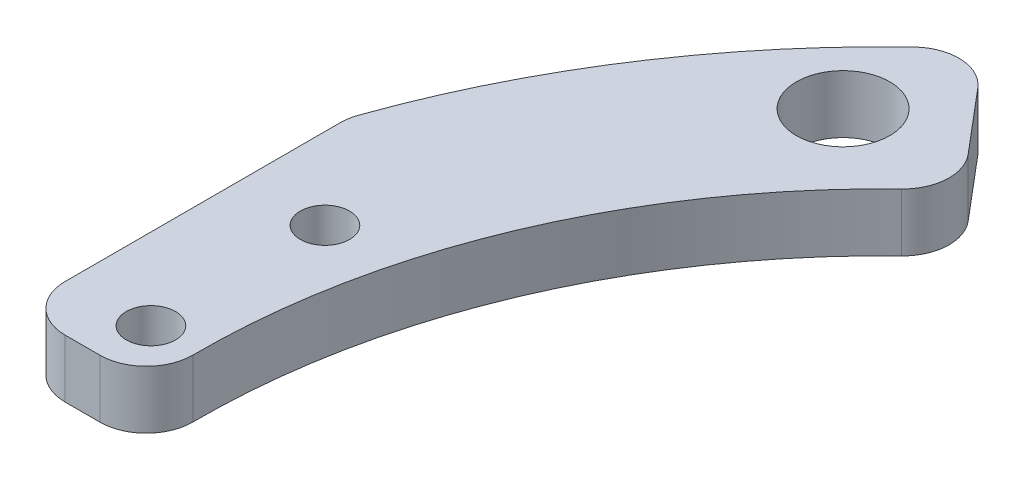
ISO-10303-21;
HEADER;
FILE_DESCRIPTION(('STEP AP214'),'2;1');
FILE_NAME('part.step','',(''),(''),'','','');
FILE_SCHEMA(('AUTOMOTIVE_DESIGN { 1 0 10303 214 1 1 1 1 }'));
ENDSEC;
DATA;
#1=APPLICATION_CONTEXT('core data for automotive mechanical design processes');
#2=APPLICATION_PROTOCOL_DEFINITION('international standard','automotive_design',2000,#1);
#3=PRODUCT_CONTEXT('',#1,'mechanical');
#4=PRODUCT('Part','Part','',(#3));
#5=PRODUCT_RELATED_PRODUCT_CATEGORY('part','',(#4));
#6=PRODUCT_DEFINITION_FORMATION('','',#4);
#7=PRODUCT_DEFINITION_CONTEXT('part definition',#1,'design');
#8=PRODUCT_DEFINITION('design','',#6,#7);
#9=PRODUCT_DEFINITION_SHAPE('','',#8);
#10=(LENGTH_UNIT() NAMED_UNIT(*) SI_UNIT(.MILLI.,.METRE.));
#11=(NAMED_UNIT(*) PLANE_ANGLE_UNIT() SI_UNIT($,.RADIAN.));
#12=(NAMED_UNIT(*) SI_UNIT($,.STERADIAN.) SOLID_ANGLE_UNIT());
#13=UNCERTAINTY_MEASURE_WITH_UNIT(LENGTH_MEASURE(1.E-05),#10,'distance_accuracy_value','');
#14=(GEOMETRIC_REPRESENTATION_CONTEXT(3) GLOBAL_UNCERTAINTY_ASSIGNED_CONTEXT((#13)) GLOBAL_UNIT_ASSIGNED_CONTEXT((#10,
#11,#12)) REPRESENTATION_CONTEXT('',''));
#15=CARTESIAN_POINT('',(0.,0.,0.));
#16=DIRECTION('',(0.,0.,1.));
#17=DIRECTION('',(1.,0.,0.));
#18=AXIS2_PLACEMENT_3D('',#15,#16,#17);
#19=CARTESIAN_POINT('',(0.,5.,0.));
#20=DIRECTION('',(0.,1.,0.));
#21=DIRECTION('',(0.,0.,1.));
#22=AXIS2_PLACEMENT_3D('',#19,#20,#21);
#23=PLANE('',#22);
#24=CARTESIAN_POINT('',(0.,5.,0.));
#25=DIRECTION('',(0.,1.,0.));
#26=DIRECTION('',(0.,0.,1.));
#27=AXIS2_PLACEMENT_3D('',#24,#25,#26);
#28=CIRCLE('',#27,74.);
#29=CARTESIAN_POINT('',(-50.9093941537347,5.,-53.7050610920394));
#30=VERTEX_POINT('',#29);
#31=CARTESIAN_POINT('',(-69.7714285714286,5.,-24.6565965839172));
#32=VERTEX_POINT('',#31);
#33=EDGE_CURVE('E126',#30,#32,#28,.T.);
#34=ORIENTED_EDGE('',*,*,#33,.T.);
#35=CARTESIAN_POINT('',(-66.,5.,-23.3238075793812));
#36=DIRECTION('',(0.,1.,0.));
#37=DIRECTION('',(0.,0.,1.));
#38=AXIS2_PLACEMENT_3D('',#35,#36,#37);
#39=CIRCLE('',#38,4.);
#40=CARTESIAN_POINT('',(-70.,5.,-23.3238075793812));
#41=VERTEX_POINT('',#40);
#42=EDGE_CURVE('E157',#32,#41,#39,.T.);
#43=ORIENTED_EDGE('',*,*,#42,.T.);
#44=DIRECTION('',(0.,0.,-1.));
#45=VECTOR('',#44,1.);
#46=CARTESIAN_POINT('',(-70.,5.,0.));
#47=LINE('',#46,#45);
#48=CARTESIAN_POINT('',(-70.,5.,0.398778143483318));
#49=VERTEX_POINT('',#48);
#50=EDGE_CURVE('E201',#49,#41,#47,.T.);
#51=ORIENTED_EDGE('',*,*,#50,.F.);
#52=CARTESIAN_POINT('',(-66.,5.,0.398778143483318));
#53=DIRECTION('',(0.,1.,0.));
#54=DIRECTION('',(0.,0.,1.));
#55=AXIS2_PLACEMENT_3D('',#52,#53,#54);
#56=CIRCLE('',#55,4.);
#57=CARTESIAN_POINT('',(-66.,5.,4.39877814348332));
#58=VERTEX_POINT('',#57);
#59=EDGE_CURVE('E155',#49,#58,#56,.T.);
#60=ORIENTED_EDGE('',*,*,#59,.T.);
#61=DIRECTION('',(-1.,0.,0.));
#62=VECTOR('',#61,1.);
#63=CARTESIAN_POINT('',(0.,5.,4.39877814348332));
#64=LINE('',#63,#62);
#65=CARTESIAN_POINT('',(-62.9987378920584,5.,4.39877814348332));
#66=VERTEX_POINT('',#65);
#67=EDGE_CURVE('E208',#66,#58,#64,.T.);
#68=ORIENTED_EDGE('',*,*,#67,.F.);
#69=CARTESIAN_POINT('',(-62.9987378920584,5.,0.398778143483318));
#70=DIRECTION('',(0.,1.,0.));
#71=DIRECTION('',(0.,0.,1.));
#72=AXIS2_PLACEMENT_3D('',#69,#70,#71);
#73=CIRCLE('',#72,4.);
#74=CARTESIAN_POINT('',(-58.998818025896,5.,0.373458896278028));
#75=VERTEX_POINT('',#74);
#76=EDGE_CURVE('E153',#66,#75,#73,.T.);
#77=ORIENTED_EDGE('',*,*,#76,.T.);
#78=CARTESIAN_POINT('',(0.,5.,0.));
#79=DIRECTION('',(0.,-1.,0.));
#80=DIRECTION('',(0.,0.,1.));
#81=AXIS2_PLACEMENT_3D('',#78,#79,#80);
#82=CIRCLE('',#81,59.);
#83=CARTESIAN_POINT('',(-40.8614618035536,5.,-42.55985126004));
#84=VERTEX_POINT('',#83);
#85=EDGE_CURVE('E185',#75,#84,#82,.T.);
#86=ORIENTED_EDGE('',*,*,#85,.T.);
#87=CARTESIAN_POINT('',(-43.6317304004047,5.,-45.4452649047885));
#88=DIRECTION('',(0.,1.,0.));
#89=DIRECTION('',(0.,0.,1.));
#90=AXIS2_PLACEMENT_3D('',#87,#88,#89);
#91=CIRCLE('',#90,4.);
#92=CARTESIAN_POINT('',(-40.5762484597032,5.,-48.026743184776));
#93=VERTEX_POINT('',#92);
#94=EDGE_CURVE('E151',#84,#93,#91,.T.);
#95=ORIENTED_EDGE('',*,*,#94,.T.);
#96=DIRECTION('',(-0.64536956999688,0.,-0.763870485175361));
#97=VECTOR('',#96,1.);
#98=CARTESIAN_POINT('',(-47.7573481797691,5.,-56.5264159029767));
#99=LINE('',#98,#97);
#100=CARTESIAN_POINT('',(-45.1020530695882,5.,-53.3835630967815));
#101=VERTEX_POINT('',#100);
#102=EDGE_CURVE('E128',#93,#101,#99,.T.);
#103=ORIENTED_EDGE('',*,*,#102,.T.);
#104=CARTESIAN_POINT('',(-48.1575350102896,5.,-50.802084816794));
#105=DIRECTION('',(0.,1.,0.));
#106=DIRECTION('',(0.,0.,1.));
#107=AXIS2_PLACEMENT_3D('',#104,#105,#106);
#108=CIRCLE('',#107,4.);
#109=EDGE_CURVE('E149',#101,#30,#108,.T.);
#110=ORIENTED_EDGE('',*,*,#109,.T.);
#111=EDGE_LOOP('',(#34,#43,#51,#60,#68,#77,#86,#95,#103,#110));
#112=FACE_BOUND('',#111,.T.);
#113=CARTESIAN_POINT('',(-49.3663748592939,5.,-46.0348893042187));
#114=DIRECTION('',(0.,1.,0.));
#115=DIRECTION('',(0.,0.,1.));
#116=AXIS2_PLACEMENT_3D('',#113,#114,#115);
#117=CIRCLE('',#116,4.025);
#118=CARTESIAN_POINT('',(-49.3663748592939,5.,-42.0098893042187));
#119=VERTEX_POINT('',#118);
#120=EDGE_CURVE('E190',#119,#119,#117,.T.);
#121=ORIENTED_EDGE('',*,*,#120,.F.);
#122=EDGE_LOOP('',(#121));
#123=FACE_BOUND('',#122,.T.);
#124=CARTESIAN_POINT('',(-63.,5.,0.));
#125=DIRECTION('',(0.,1.,0.));
#126=DIRECTION('',(0.,0.,1.));
#127=AXIS2_PLACEMENT_3D('',#124,#125,#126);
#128=CIRCLE('',#127,2.125);
#129=CARTESIAN_POINT('',(-63.,5.,2.12500000000001));
#130=VERTEX_POINT('',#129);
#131=EDGE_CURVE('E136',#130,#130,#128,.T.);
#132=ORIENTED_EDGE('',*,*,#131,.F.);
#133=EDGE_LOOP('',(#132));
#134=FACE_BOUND('',#133,.T.);
#135=CARTESIAN_POINT('',(-63.,5.,-15.));
#136=DIRECTION('',(0.,1.,0.));
#137=DIRECTION('',(0.,0.,1.));
#138=AXIS2_PLACEMENT_3D('',#135,#136,#137);
#139=CIRCLE('',#138,2.125);
#140=CARTESIAN_POINT('',(-63.,5.,-12.875));
#141=VERTEX_POINT('',#140);
#142=EDGE_CURVE('E195',#141,#141,#139,.T.);
#143=ORIENTED_EDGE('',*,*,#142,.F.);
#144=EDGE_LOOP('',(#143));
#145=FACE_BOUND('',#144,.T.);
#146=ADVANCED_FACE('F35',(#112,#123,#134,#145),#23,.T.);
#147=CARTESIAN_POINT('',(0.,0.,0.));
#148=DIRECTION('',(0.,1.,0.));
#149=DIRECTION('',(0.,0.,1.));
#150=AXIS2_PLACEMENT_3D('',#147,#148,#149);
#151=PLANE('',#150);
#152=DIRECTION('',(0.,0.,-1.));
#153=VECTOR('',#152,1.);
#154=CARTESIAN_POINT('',(-70.,0.,-27.6660560000425));
#155=LINE('',#154,#153);
#156=CARTESIAN_POINT('',(-70.,0.,0.398778143483318));
#157=VERTEX_POINT('',#156);
#158=CARTESIAN_POINT('',(-70.,0.,-23.3238075793812));
#159=VERTEX_POINT('',#158);
#160=EDGE_CURVE('E206',#157,#159,#155,.T.);
#161=ORIENTED_EDGE('',*,*,#160,.T.);
#162=CARTESIAN_POINT('',(-66.,0.,-23.3238075793812));
#163=DIRECTION('',(0.,1.,0.));
#164=DIRECTION('',(0.,0.,1.));
#165=AXIS2_PLACEMENT_3D('',#162,#163,#164);
#166=CIRCLE('',#165,4.);
#167=CARTESIAN_POINT('',(-69.7714285714286,0.,-24.6565965839172));
#168=VERTEX_POINT('',#167);
#169=EDGE_CURVE('E134',#159,#168,#166,.F.);
#170=ORIENTED_EDGE('',*,*,#169,.T.);
#171=CARTESIAN_POINT('',(0.,0.,0.));
#172=DIRECTION('',(0.,1.,0.));
#173=DIRECTION('',(0.,0.,1.));
#174=AXIS2_PLACEMENT_3D('',#171,#172,#173);
#175=CIRCLE('',#174,74.);
#176=CARTESIAN_POINT('',(-50.9093941537347,0.,-53.7050610920394));
#177=VERTEX_POINT('',#176);
#178=EDGE_CURVE('E123',#177,#168,#175,.T.);
#179=ORIENTED_EDGE('',*,*,#178,.F.);
#180=CARTESIAN_POINT('',(-48.1575350102896,0.,-50.802084816794));
#181=DIRECTION('',(0.,1.,0.));
#182=DIRECTION('',(0.,0.,1.));
#183=AXIS2_PLACEMENT_3D('',#180,#181,#182);
#184=CIRCLE('',#183,4.);
#185=CARTESIAN_POINT('',(-45.1020530695882,0.,-53.3835630967815));
#186=VERTEX_POINT('',#185);
#187=EDGE_CURVE('E50',#177,#186,#184,.F.);
#188=ORIENTED_EDGE('',*,*,#187,.T.);
#189=DIRECTION('',(-0.64536956999688,0.,-0.763870485175361));
#190=VECTOR('',#189,1.);
#191=CARTESIAN_POINT('',(-47.7573481797691,0.,-56.5264159029767));
#192=LINE('',#191,#190);
#193=CARTESIAN_POINT('',(-40.5762484597032,0.,-48.026743184776));
#194=VERTEX_POINT('',#193);
#195=EDGE_CURVE('E139',#194,#186,#192,.T.);
#196=ORIENTED_EDGE('',*,*,#195,.F.);
#197=CARTESIAN_POINT('',(-43.6317304004047,0.,-45.4452649047885));
#198=DIRECTION('',(0.,1.,0.));
#199=DIRECTION('',(0.,0.,1.));
#200=AXIS2_PLACEMENT_3D('',#197,#198,#199);
#201=CIRCLE('',#200,4.);
#202=CARTESIAN_POINT('',(-40.8614618035536,0.,-42.55985126004));
#203=VERTEX_POINT('',#202);
#204=EDGE_CURVE('E58',#194,#203,#201,.F.);
#205=ORIENTED_EDGE('',*,*,#204,.T.);
#206=CARTESIAN_POINT('',(0.,0.,0.));
#207=DIRECTION('',(0.,-1.,0.));
#208=DIRECTION('',(0.,0.,1.));
#209=AXIS2_PLACEMENT_3D('',#206,#207,#208);
#210=CIRCLE('',#209,59.);
#211=CARTESIAN_POINT('',(-58.998818025896,0.,0.373458896278028));
#212=VERTEX_POINT('',#211);
#213=EDGE_CURVE('E135',#212,#203,#210,.T.);
#214=ORIENTED_EDGE('',*,*,#213,.F.);
#215=CARTESIAN_POINT('',(-62.9987378920584,0.,0.398778143483318));
#216=DIRECTION('',(0.,1.,0.));
#217=DIRECTION('',(0.,0.,1.));
#218=AXIS2_PLACEMENT_3D('',#215,#216,#217);
#219=CIRCLE('',#218,4.);
#220=CARTESIAN_POINT('',(-62.9987378920584,0.,4.39877814348332));
#221=VERTEX_POINT('',#220);
#222=EDGE_CURVE('E164',#212,#221,#219,.F.);
#223=ORIENTED_EDGE('',*,*,#222,.T.);
#224=DIRECTION('',(-1.,0.,0.));
#225=VECTOR('',#224,1.);
#226=CARTESIAN_POINT('',(-70.,0.,4.39877814348332));
#227=LINE('',#226,#225);
#228=CARTESIAN_POINT('',(-66.,0.,4.39877814348332));
#229=VERTEX_POINT('',#228);
#230=EDGE_CURVE('E211',#221,#229,#227,.T.);
#231=ORIENTED_EDGE('',*,*,#230,.T.);
#232=CARTESIAN_POINT('',(-66.,0.,0.398778143483318));
#233=DIRECTION('',(0.,1.,0.));
#234=DIRECTION('',(0.,0.,1.));
#235=AXIS2_PLACEMENT_3D('',#232,#233,#234);
#236=CIRCLE('',#235,4.);
#237=EDGE_CURVE('E166',#229,#157,#236,.F.);
#238=ORIENTED_EDGE('',*,*,#237,.T.);
#239=EDGE_LOOP('',(#161,#170,#179,#188,#196,#205,#214,#223,#231,#238));
#240=FACE_BOUND('',#239,.T.);
#241=CARTESIAN_POINT('',(-63.,0.,0.));
#242=DIRECTION('',(0.,1.,0.));
#243=DIRECTION('',(0.,0.,1.));
#244=AXIS2_PLACEMENT_3D('',#241,#242,#243);
#245=CIRCLE('',#244,2.125);
#246=CARTESIAN_POINT('',(-63.,0.,2.12500000000001));
#247=VERTEX_POINT('',#246);
#248=EDGE_CURVE('E142',#247,#247,#245,.T.);
#249=ORIENTED_EDGE('',*,*,#248,.T.);
#250=EDGE_LOOP('',(#249));
#251=FACE_BOUND('',#250,.T.);
#252=CARTESIAN_POINT('',(-49.3663748592939,0.,-46.0348893042187));
#253=DIRECTION('',(0.,1.,0.));
#254=DIRECTION('',(0.,0.,1.));
#255=AXIS2_PLACEMENT_3D('',#252,#253,#254);
#256=CIRCLE('',#255,4.025);
#257=CARTESIAN_POINT('',(-49.3663748592939,0.,-42.0098893042187));
#258=VERTEX_POINT('',#257);
#259=EDGE_CURVE('E192',#258,#258,#256,.T.);
#260=ORIENTED_EDGE('',*,*,#259,.T.);
#261=EDGE_LOOP('',(#260));
#262=FACE_BOUND('',#261,.T.);
#263=CARTESIAN_POINT('',(-63.,0.,-15.));
#264=DIRECTION('',(0.,1.,0.));
#265=DIRECTION('',(0.,0.,1.));
#266=AXIS2_PLACEMENT_3D('',#263,#264,#265);
#267=CIRCLE('',#266,2.125);
#268=CARTESIAN_POINT('',(-63.,0.,-12.875));
#269=VERTEX_POINT('',#268);
#270=EDGE_CURVE('E198',#269,#269,#267,.T.);
#271=ORIENTED_EDGE('',*,*,#270,.T.);
#272=EDGE_LOOP('',(#271));
#273=FACE_BOUND('',#272,.T.);
#274=ADVANCED_FACE('F131',(#240,#251,#262,#273),#151,.F.);
#275=CARTESIAN_POINT('',(0.,5.,0.));
#276=DIRECTION('',(0.,-1.,0.));
#277=DIRECTION('',(0.,0.,-1.));
#278=AXIS2_PLACEMENT_3D('',#275,#276,#277);
#279=CYLINDRICAL_SURFACE('',#278,74.);
#280=ORIENTED_EDGE('',*,*,#178,.T.);
#281=DIRECTION('',(0.,-1.,0.));
#282=VECTOR('',#281,1.);
#283=CARTESIAN_POINT('',(-69.7714285714286,5.,-24.6565965839172));
#284=LINE('',#283,#282);
#285=EDGE_CURVE('E127',#168,#32,#284,.F.);
#286=ORIENTED_EDGE('',*,*,#285,.T.);
#287=ORIENTED_EDGE('',*,*,#33,.F.);
#288=DIRECTION('',(0.,-1.,0.));
#289=VECTOR('',#288,1.);
#290=CARTESIAN_POINT('',(-50.9093941537347,5.,-53.7050610920394));
#291=LINE('',#290,#289);
#292=EDGE_CURVE('E115',#30,#177,#291,.T.);
#293=ORIENTED_EDGE('',*,*,#292,.T.);
#294=EDGE_LOOP('',(#280,#286,#287,#293));
#295=FACE_BOUND('',#294,.T.);
#296=ADVANCED_FACE('F121',(#295),#279,.T.);
#297=CARTESIAN_POINT('',(0.,5.,0.));
#298=DIRECTION('',(0.,-1.,0.));
#299=DIRECTION('',(0.,0.,-1.));
#300=AXIS2_PLACEMENT_3D('',#297,#298,#299);
#301=CYLINDRICAL_SURFACE('',#300,59.);
#302=ORIENTED_EDGE('',*,*,#85,.F.);
#303=DIRECTION('',(0.,-1.,0.));
#304=VECTOR('',#303,1.);
#305=CARTESIAN_POINT('',(-58.998818025896,5.,0.373458896278028));
#306=LINE('',#305,#304);
#307=EDGE_CURVE('E175',#75,#212,#306,.T.);
#308=ORIENTED_EDGE('',*,*,#307,.T.);
#309=ORIENTED_EDGE('',*,*,#213,.T.);
#310=DIRECTION('',(0.,-1.,0.));
#311=VECTOR('',#310,1.);
#312=CARTESIAN_POINT('',(-40.8614618035536,5.,-42.5598512600401));
#313=LINE('',#312,#311);
#314=EDGE_CURVE('E173',#203,#84,#313,.F.);
#315=ORIENTED_EDGE('',*,*,#314,.T.);
#316=EDGE_LOOP('',(#302,#308,#309,#315));
#317=FACE_BOUND('',#316,.T.);
#318=ADVANCED_FACE('F253',(#317),#301,.F.);
#319=CARTESIAN_POINT('',(-47.7573481797691,5.,-56.5264159029767));
#320=DIRECTION('',(-0.763870485175361,0.,0.64536956999688));
#321=DIRECTION('',(0.64536956999688,0.,0.763870485175361));
#322=AXIS2_PLACEMENT_3D('',#319,#320,#321);
#323=PLANE('',#322);
#324=ORIENTED_EDGE('',*,*,#102,.F.);
#325=DIRECTION('',(0.,-1.,0.));
#326=VECTOR('',#325,1.);
#327=CARTESIAN_POINT('',(-40.5762484597032,5.,-48.026743184776));
#328=LINE('',#327,#326);
#329=EDGE_CURVE('E11',#93,#194,#328,.T.);
#330=ORIENTED_EDGE('',*,*,#329,.T.);
#331=ORIENTED_EDGE('',*,*,#195,.T.);
#332=DIRECTION('',(0.,-1.,0.));
#333=VECTOR('',#332,1.);
#334=CARTESIAN_POINT('',(-45.1020530695882,5.,-53.3835630967815));
#335=LINE('',#334,#333);
#336=EDGE_CURVE('E43',#186,#101,#335,.F.);
#337=ORIENTED_EDGE('',*,*,#336,.T.);
#338=EDGE_LOOP('',(#324,#330,#331,#337));
#339=FACE_BOUND('',#338,.T.);
#340=ADVANCED_FACE('F180',(#339),#323,.F.);
#341=CARTESIAN_POINT('',(-63.,5.,0.));
#342=DIRECTION('',(0.,-1.,0.));
#343=DIRECTION('',(0.,0.,-1.));
#344=AXIS2_PLACEMENT_3D('',#341,#342,#343);
#345=CYLINDRICAL_SURFACE('',#344,2.125);
#346=ORIENTED_EDGE('',*,*,#131,.T.);
#347=EDGE_LOOP('',(#346));
#348=FACE_BOUND('',#347,.T.);
#349=ORIENTED_EDGE('',*,*,#248,.F.);
#350=EDGE_LOOP('',(#349));
#351=FACE_BOUND('',#350,.T.);
#352=ADVANCED_FACE('F248',(#348,#351),#345,.F.);
#353=CARTESIAN_POINT('',(-49.3663748592939,5.,-46.0348893042187));
#354=DIRECTION('',(0.,-1.,0.));
#355=DIRECTION('',(0.,0.,-1.));
#356=AXIS2_PLACEMENT_3D('',#353,#354,#355);
#357=CYLINDRICAL_SURFACE('',#356,4.025);
#358=ORIENTED_EDGE('',*,*,#120,.T.);
#359=EDGE_LOOP('',(#358));
#360=FACE_BOUND('',#359,.T.);
#361=ORIENTED_EDGE('',*,*,#259,.F.);
#362=EDGE_LOOP('',(#361));
#363=FACE_BOUND('',#362,.T.);
#364=ADVANCED_FACE('F276',(#360,#363),#357,.F.);
#365=CARTESIAN_POINT('',(-63.,5.,-15.));
#366=DIRECTION('',(0.,-1.,0.));
#367=DIRECTION('',(0.,0.,-1.));
#368=AXIS2_PLACEMENT_3D('',#365,#366,#367);
#369=CYLINDRICAL_SURFACE('',#368,2.125);
#370=ORIENTED_EDGE('',*,*,#142,.T.);
#371=EDGE_LOOP('',(#370));
#372=FACE_BOUND('',#371,.T.);
#373=ORIENTED_EDGE('',*,*,#270,.F.);
#374=EDGE_LOOP('',(#373));
#375=FACE_BOUND('',#374,.T.);
#376=ADVANCED_FACE('F283',(#372,#375),#369,.F.);
#377=CARTESIAN_POINT('',(-70.,0.,-27.6660560000425));
#378=DIRECTION('',(1.,0.,0.));
#379=DIRECTION('',(0.,0.,-1.));
#380=AXIS2_PLACEMENT_3D('',#377,#378,#379);
#381=PLANE('',#380);
#382=ORIENTED_EDGE('',*,*,#50,.T.);
#383=DIRECTION('',(0.,-1.,0.));
#384=VECTOR('',#383,1.);
#385=CARTESIAN_POINT('',(-70.,0.,-23.3238075793812));
#386=LINE('',#385,#384);
#387=EDGE_CURVE('E116',#41,#159,#386,.T.);
#388=ORIENTED_EDGE('',*,*,#387,.T.);
#389=ORIENTED_EDGE('',*,*,#160,.F.);
#390=DIRECTION('',(0.,1.,0.));
#391=VECTOR('',#390,1.);
#392=CARTESIAN_POINT('',(-70.,0.,0.398778143483318));
#393=LINE('',#392,#391);
#394=EDGE_CURVE('E159',#157,#49,#393,.T.);
#395=ORIENTED_EDGE('',*,*,#394,.T.);
#396=EDGE_LOOP('',(#382,#388,#389,#395));
#397=FACE_BOUND('',#396,.T.);
#398=ADVANCED_FACE('F225',(#397),#381,.F.);
#399=CARTESIAN_POINT('',(-70.,0.,4.39877814348332));
#400=DIRECTION('',(0.,0.,-1.));
#401=DIRECTION('',(-1.,0.,0.));
#402=AXIS2_PLACEMENT_3D('',#399,#400,#401);
#403=PLANE('',#402);
#404=ORIENTED_EDGE('',*,*,#67,.T.);
#405=DIRECTION('',(0.,1.,0.));
#406=VECTOR('',#405,1.);
#407=CARTESIAN_POINT('',(-66.,0.,4.39877814348332));
#408=LINE('',#407,#406);
#409=EDGE_CURVE('E171',#58,#229,#408,.F.);
#410=ORIENTED_EDGE('',*,*,#409,.T.);
#411=ORIENTED_EDGE('',*,*,#230,.F.);
#412=DIRECTION('',(0.,-1.,0.));
#413=VECTOR('',#412,1.);
#414=CARTESIAN_POINT('',(-62.9987378920584,0.,4.39877814348332));
#415=LINE('',#414,#413);
#416=EDGE_CURVE('E169',#221,#66,#415,.F.);
#417=ORIENTED_EDGE('',*,*,#416,.T.);
#418=EDGE_LOOP('',(#404,#410,#411,#417));
#419=FACE_BOUND('',#418,.T.);
#420=ADVANCED_FACE('F231',(#419),#403,.F.);
#421=CARTESIAN_POINT('',(-66.,5.,-23.3238075793812));
#422=DIRECTION('',(0.,-1.,0.));
#423=DIRECTION('',(0.,0.,-1.));
#424=AXIS2_PLACEMENT_3D('',#421,#422,#423);
#425=CYLINDRICAL_SURFACE('',#424,4.);
#426=ORIENTED_EDGE('',*,*,#169,.F.);
#427=ORIENTED_EDGE('',*,*,#387,.F.);
#428=ORIENTED_EDGE('',*,*,#42,.F.);
#429=ORIENTED_EDGE('',*,*,#285,.F.);
#430=EDGE_LOOP('',(#426,#427,#428,#429));
#431=FACE_BOUND('',#430,.T.);
#432=ADVANCED_FACE('F229',(#431),#425,.T.);
#433=CARTESIAN_POINT('',(-66.,0.,0.398778143483318));
#434=DIRECTION('',(0.,1.,0.));
#435=DIRECTION('',(0.,0.,1.));
#436=AXIS2_PLACEMENT_3D('',#433,#434,#435);
#437=CYLINDRICAL_SURFACE('',#436,4.);
#438=ORIENTED_EDGE('',*,*,#237,.F.);
#439=ORIENTED_EDGE('',*,*,#409,.F.);
#440=ORIENTED_EDGE('',*,*,#59,.F.);
#441=ORIENTED_EDGE('',*,*,#394,.F.);
#442=EDGE_LOOP('',(#438,#439,#440,#441));
#443=FACE_BOUND('',#442,.T.);
#444=ADVANCED_FACE('F222',(#443),#437,.T.);
#445=CARTESIAN_POINT('',(-62.9987378920584,5.,0.398778143483318));
#446=DIRECTION('',(0.,-1.,0.));
#447=DIRECTION('',(0.,0.,-1.));
#448=AXIS2_PLACEMENT_3D('',#445,#446,#447);
#449=CYLINDRICAL_SURFACE('',#448,4.);
#450=ORIENTED_EDGE('',*,*,#76,.F.);
#451=ORIENTED_EDGE('',*,*,#416,.F.);
#452=ORIENTED_EDGE('',*,*,#222,.F.);
#453=ORIENTED_EDGE('',*,*,#307,.F.);
#454=EDGE_LOOP('',(#450,#451,#452,#453));
#455=FACE_BOUND('',#454,.T.);
#456=ADVANCED_FACE('F237',(#455),#449,.T.);
#457=CARTESIAN_POINT('',(-43.6317304004047,5.,-45.4452649047885));
#458=DIRECTION('',(0.,-1.,0.));
#459=DIRECTION('',(0.,0.,-1.));
#460=AXIS2_PLACEMENT_3D('',#457,#458,#459);
#461=CYLINDRICAL_SURFACE('',#460,4.);
#462=ORIENTED_EDGE('',*,*,#94,.F.);
#463=ORIENTED_EDGE('',*,*,#314,.F.);
#464=ORIENTED_EDGE('',*,*,#204,.F.);
#465=ORIENTED_EDGE('',*,*,#329,.F.);
#466=EDGE_LOOP('',(#462,#463,#464,#465));
#467=FACE_BOUND('',#466,.T.);
#468=ADVANCED_FACE('F319',(#467),#461,.T.);
#469=CARTESIAN_POINT('',(-48.1575350102896,5.,-50.802084816794));
#470=DIRECTION('',(0.,-1.,0.));
#471=DIRECTION('',(0.,0.,-1.));
#472=AXIS2_PLACEMENT_3D('',#469,#470,#471);
#473=CYLINDRICAL_SURFACE('',#472,4.);
#474=ORIENTED_EDGE('',*,*,#109,.F.);
#475=ORIENTED_EDGE('',*,*,#336,.F.);
#476=ORIENTED_EDGE('',*,*,#187,.F.);
#477=ORIENTED_EDGE('',*,*,#292,.F.);
#478=EDGE_LOOP('',(#474,#475,#476,#477));
#479=FACE_BOUND('',#478,.T.);
#480=ADVANCED_FACE('F37',(#479),#473,.T.);
#481=CLOSED_SHELL('',(#146,#274,#296,#318,#340,#352,#364,#376,#398,#420,#432,#444,#456,#468,#480));
#482=MANIFOLD_SOLID_BREP('B2',#481);
#483=ADVANCED_BREP_SHAPE_REPRESENTATION('',(#18,#482),#14);
#484=SHAPE_DEFINITION_REPRESENTATION(#9,#483);
ENDSEC;
END-ISO-10303-21;
